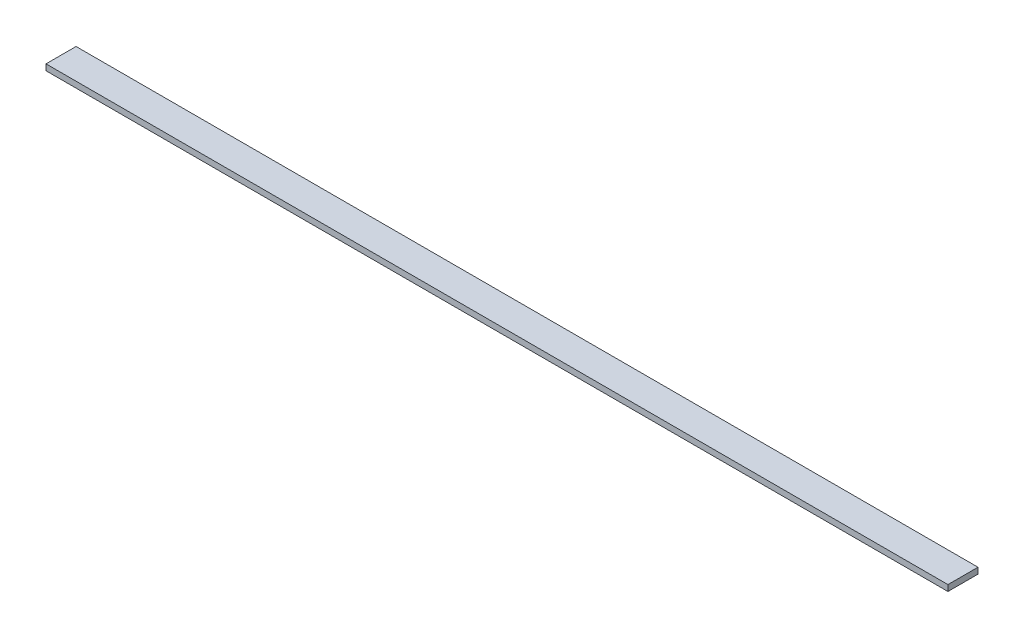
ISO-10303-21;
HEADER;
FILE_DESCRIPTION(('STEP AP214'),'2;1');
FILE_NAME('part.step','',(''),(''),'','','');
FILE_SCHEMA(('AUTOMOTIVE_DESIGN { 1 0 10303 214 1 1 1 1 }'));
ENDSEC;
DATA;
#1=APPLICATION_CONTEXT('core data for automotive mechanical design processes');
#2=APPLICATION_PROTOCOL_DEFINITION('international standard','automotive_design',2000,#1);
#3=PRODUCT_CONTEXT('',#1,'mechanical');
#4=PRODUCT('Part','Part','',(#3));
#5=PRODUCT_RELATED_PRODUCT_CATEGORY('part','',(#4));
#6=PRODUCT_DEFINITION_FORMATION('','',#4);
#7=PRODUCT_DEFINITION_CONTEXT('part definition',#1,'design');
#8=PRODUCT_DEFINITION('design','',#6,#7);
#9=PRODUCT_DEFINITION_SHAPE('','',#8);
#10=(LENGTH_UNIT() NAMED_UNIT(*) SI_UNIT(.MILLI.,.METRE.));
#11=(NAMED_UNIT(*) PLANE_ANGLE_UNIT() SI_UNIT($,.RADIAN.));
#12=(NAMED_UNIT(*) SI_UNIT($,.STERADIAN.) SOLID_ANGLE_UNIT());
#13=UNCERTAINTY_MEASURE_WITH_UNIT(LENGTH_MEASURE(1.E-05),#10,'distance_accuracy_value','');
#14=(GEOMETRIC_REPRESENTATION_CONTEXT(3) GLOBAL_UNCERTAINTY_ASSIGNED_CONTEXT((#13)) GLOBAL_UNIT_ASSIGNED_CONTEXT((#10,
#11,#12)) REPRESENTATION_CONTEXT('',''));
#15=CARTESIAN_POINT('',(0.,0.,0.));
#16=DIRECTION('',(0.,0.,1.));
#17=DIRECTION('',(1.,0.,0.));
#18=AXIS2_PLACEMENT_3D('',#15,#16,#17);
#19=CARTESIAN_POINT('',(600.,8.,-20.));
#20=DIRECTION('',(-1.,0.,0.));
#21=DIRECTION('',(0.,0.,1.));
#22=AXIS2_PLACEMENT_3D('',#19,#20,#21);
#23=PLANE('',#22);
#24=DIRECTION('',(0.,0.,-1.));
#25=VECTOR('',#24,1.);
#26=CARTESIAN_POINT('',(600.,0.,-20.));
#27=LINE('',#26,#25);
#28=CARTESIAN_POINT('',(600.,0.,20.));
#29=VERTEX_POINT('',#28);
#30=CARTESIAN_POINT('',(600.,0.,-20.));
#31=VERTEX_POINT('',#30);
#32=EDGE_CURVE('E100',#29,#31,#27,.T.);
#33=ORIENTED_EDGE('',*,*,#32,.T.);
#34=DIRECTION('',(0.,-1.,0.));
#35=VECTOR('',#34,1.);
#36=CARTESIAN_POINT('',(600.,8.,-20.));
#37=LINE('',#36,#35);
#38=CARTESIAN_POINT('',(600.,8.,-20.));
#39=VERTEX_POINT('',#38);
#40=EDGE_CURVE('E11',#39,#31,#37,.T.);
#41=ORIENTED_EDGE('',*,*,#40,.F.);
#42=DIRECTION('',(0.,0.,-1.));
#43=VECTOR('',#42,1.);
#44=CARTESIAN_POINT('',(600.,8.,-20.));
#45=LINE('',#44,#43);
#46=CARTESIAN_POINT('',(600.,8.,20.));
#47=VERTEX_POINT('',#46);
#48=EDGE_CURVE('E88',#47,#39,#45,.T.);
#49=ORIENTED_EDGE('',*,*,#48,.F.);
#50=DIRECTION('',(0.,-1.,0.));
#51=VECTOR('',#50,1.);
#52=CARTESIAN_POINT('',(600.,8.,20.));
#53=LINE('',#52,#51);
#54=EDGE_CURVE('E96',#47,#29,#53,.T.);
#55=ORIENTED_EDGE('',*,*,#54,.T.);
#56=EDGE_LOOP('',(#33,#41,#49,#55));
#57=FACE_BOUND('',#56,.T.);
#58=ADVANCED_FACE('F37',(#57),#23,.F.);
#59=CARTESIAN_POINT('',(-600.,8.,-20.));
#60=DIRECTION('',(0.,0.,1.));
#61=DIRECTION('',(1.,0.,0.));
#62=AXIS2_PLACEMENT_3D('',#59,#60,#61);
#63=PLANE('',#62);
#64=DIRECTION('',(-1.,0.,0.));
#65=VECTOR('',#64,1.);
#66=CARTESIAN_POINT('',(-600.,0.,-20.));
#67=LINE('',#66,#65);
#68=CARTESIAN_POINT('',(-600.,0.,-20.));
#69=VERTEX_POINT('',#68);
#70=EDGE_CURVE('E92',#31,#69,#67,.T.);
#71=ORIENTED_EDGE('',*,*,#70,.T.);
#72=DIRECTION('',(0.,-1.,0.));
#73=VECTOR('',#72,1.);
#74=CARTESIAN_POINT('',(-600.,8.,-20.));
#75=LINE('',#74,#73);
#76=CARTESIAN_POINT('',(-600.,8.,-20.));
#77=VERTEX_POINT('',#76);
#78=EDGE_CURVE('E45',#77,#69,#75,.T.);
#79=ORIENTED_EDGE('',*,*,#78,.F.);
#80=DIRECTION('',(-1.,0.,0.));
#81=VECTOR('',#80,1.);
#82=CARTESIAN_POINT('',(-600.,8.,-20.));
#83=LINE('',#82,#81);
#84=EDGE_CURVE('E83',#39,#77,#83,.T.);
#85=ORIENTED_EDGE('',*,*,#84,.F.);
#86=ORIENTED_EDGE('',*,*,#40,.T.);
#87=EDGE_LOOP('',(#71,#79,#85,#86));
#88=FACE_BOUND('',#87,.T.);
#89=ADVANCED_FACE('F91',(#88),#63,.F.);
#90=CARTESIAN_POINT('',(-600.,8.,-20.));
#91=DIRECTION('',(1.,0.,0.));
#92=DIRECTION('',(0.,0.,-1.));
#93=AXIS2_PLACEMENT_3D('',#90,#91,#92);
#94=PLANE('',#93);
#95=DIRECTION('',(0.,0.,1.));
#96=VECTOR('',#95,1.);
#97=CARTESIAN_POINT('',(-600.,0.,-20.));
#98=LINE('',#97,#96);
#99=CARTESIAN_POINT('',(-600.,0.,20.));
#100=VERTEX_POINT('',#99);
#101=EDGE_CURVE('E70',#69,#100,#98,.T.);
#102=ORIENTED_EDGE('',*,*,#101,.T.);
#103=DIRECTION('',(0.,-1.,0.));
#104=VECTOR('',#103,1.);
#105=CARTESIAN_POINT('',(-600.,8.,20.));
#106=LINE('',#105,#104);
#107=CARTESIAN_POINT('',(-600.,8.,20.));
#108=VERTEX_POINT('',#107);
#109=EDGE_CURVE('E93',#108,#100,#106,.T.);
#110=ORIENTED_EDGE('',*,*,#109,.F.);
#111=DIRECTION('',(0.,0.,1.));
#112=VECTOR('',#111,1.);
#113=CARTESIAN_POINT('',(-600.,8.,-20.));
#114=LINE('',#113,#112);
#115=EDGE_CURVE('E86',#77,#108,#114,.T.);
#116=ORIENTED_EDGE('',*,*,#115,.F.);
#117=ORIENTED_EDGE('',*,*,#78,.T.);
#118=EDGE_LOOP('',(#102,#110,#116,#117));
#119=FACE_BOUND('',#118,.T.);
#120=ADVANCED_FACE('F94',(#119),#94,.F.);
#121=CARTESIAN_POINT('',(-600.,8.,20.));
#122=DIRECTION('',(0.,0.,-1.));
#123=DIRECTION('',(-1.,0.,0.));
#124=AXIS2_PLACEMENT_3D('',#121,#122,#123);
#125=PLANE('',#124);
#126=DIRECTION('',(1.,0.,0.));
#127=VECTOR('',#126,1.);
#128=CARTESIAN_POINT('',(-600.,0.,20.));
#129=LINE('',#128,#127);
#130=EDGE_CURVE('E76',#100,#29,#129,.T.);
#131=ORIENTED_EDGE('',*,*,#130,.T.);
#132=ORIENTED_EDGE('',*,*,#54,.F.);
#133=DIRECTION('',(1.,0.,0.));
#134=VECTOR('',#133,1.);
#135=CARTESIAN_POINT('',(-600.,8.,20.));
#136=LINE('',#135,#134);
#137=EDGE_CURVE('E53',#108,#47,#136,.T.);
#138=ORIENTED_EDGE('',*,*,#137,.F.);
#139=ORIENTED_EDGE('',*,*,#109,.T.);
#140=EDGE_LOOP('',(#131,#132,#138,#139));
#141=FACE_BOUND('',#140,.T.);
#142=ADVANCED_FACE('F107',(#141),#125,.F.);
#143=CARTESIAN_POINT('',(0.,8.,0.));
#144=DIRECTION('',(0.,1.,0.));
#145=DIRECTION('',(0.,0.,1.));
#146=AXIS2_PLACEMENT_3D('',#143,#144,#145);
#147=PLANE('',#146);
#148=ORIENTED_EDGE('',*,*,#48,.T.);
#149=ORIENTED_EDGE('',*,*,#84,.T.);
#150=ORIENTED_EDGE('',*,*,#115,.T.);
#151=ORIENTED_EDGE('',*,*,#137,.T.);
#152=EDGE_LOOP('',(#148,#149,#150,#151));
#153=FACE_BOUND('',#152,.T.);
#154=ADVANCED_FACE('F84',(#153),#147,.T.);
#155=CARTESIAN_POINT('',(0.,0.,0.));
#156=DIRECTION('',(0.,1.,0.));
#157=DIRECTION('',(0.,0.,1.));
#158=AXIS2_PLACEMENT_3D('',#155,#156,#157);
#159=PLANE('',#158);
#160=ORIENTED_EDGE('',*,*,#32,.F.);
#161=ORIENTED_EDGE('',*,*,#130,.F.);
#162=ORIENTED_EDGE('',*,*,#101,.F.);
#163=ORIENTED_EDGE('',*,*,#70,.F.);
#164=EDGE_LOOP('',(#160,#161,#162,#163));
#165=FACE_BOUND('',#164,.T.);
#166=ADVANCED_FACE('F110',(#165),#159,.F.);
#167=CLOSED_SHELL('',(#58,#89,#120,#142,#154,#166));
#168=MANIFOLD_SOLID_BREP('B2',#167);
#169=ADVANCED_BREP_SHAPE_REPRESENTATION('',(#18,#168),#14);
#170=SHAPE_DEFINITION_REPRESENTATION(#9,#169);
ENDSEC;
END-ISO-10303-21;
